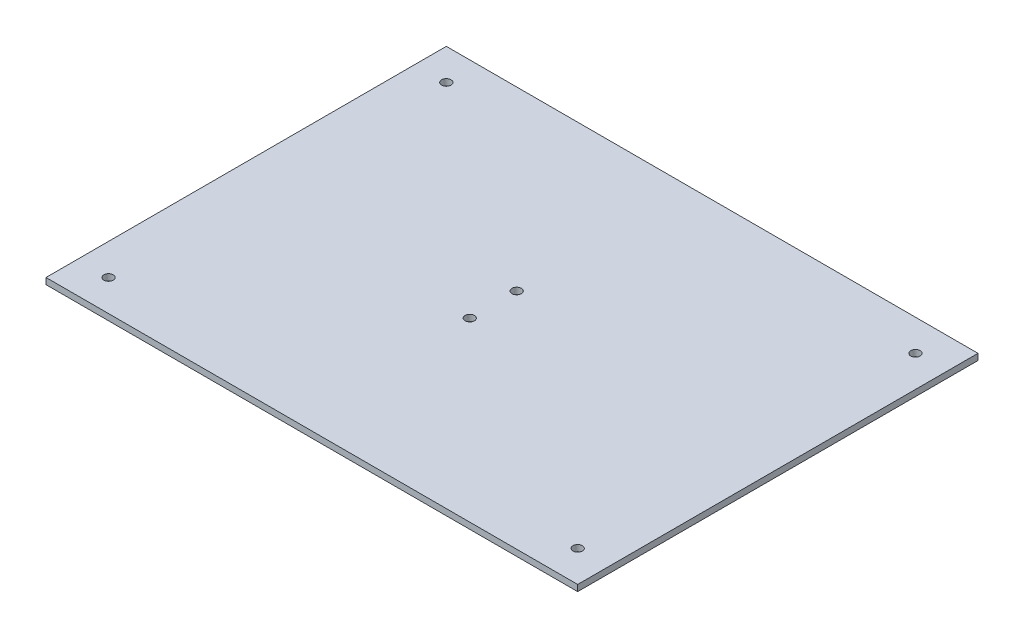
ISO-10303-21;
HEADER;
FILE_DESCRIPTION(('STEP AP214'),'2;1');
FILE_NAME('part.step','',(''),(''),'','','');
FILE_SCHEMA(('AUTOMOTIVE_DESIGN { 1 0 10303 214 1 1 1 1 }'));
ENDSEC;
DATA;
#1=APPLICATION_CONTEXT('core data for automotive mechanical design processes');
#2=APPLICATION_PROTOCOL_DEFINITION('international standard','automotive_design',2000,#1);
#3=PRODUCT_CONTEXT('',#1,'mechanical');
#4=PRODUCT('Part','Part','',(#3));
#5=PRODUCT_RELATED_PRODUCT_CATEGORY('part','',(#4));
#6=PRODUCT_DEFINITION_FORMATION('','',#4);
#7=PRODUCT_DEFINITION_CONTEXT('part definition',#1,'design');
#8=PRODUCT_DEFINITION('design','',#6,#7);
#9=PRODUCT_DEFINITION_SHAPE('','',#8);
#10=(LENGTH_UNIT() NAMED_UNIT(*) SI_UNIT(.MILLI.,.METRE.));
#11=(NAMED_UNIT(*) PLANE_ANGLE_UNIT() SI_UNIT($,.RADIAN.));
#12=(NAMED_UNIT(*) SI_UNIT($,.STERADIAN.) SOLID_ANGLE_UNIT());
#13=UNCERTAINTY_MEASURE_WITH_UNIT(LENGTH_MEASURE(1.E-05),#10,'distance_accuracy_value','');
#14=(GEOMETRIC_REPRESENTATION_CONTEXT(3) GLOBAL_UNCERTAINTY_ASSIGNED_CONTEXT((#13)) GLOBAL_UNIT_ASSIGNED_CONTEXT((#10,
#11,#12)) REPRESENTATION_CONTEXT('',''));
#15=CARTESIAN_POINT('',(0.,0.,0.));
#16=DIRECTION('',(0.,0.,1.));
#17=DIRECTION('',(1.,0.,0.));
#18=AXIS2_PLACEMENT_3D('',#15,#16,#17);
#19=CARTESIAN_POINT('',(0.,2.,0.));
#20=DIRECTION('',(0.,1.,0.));
#21=DIRECTION('',(0.,0.,1.));
#22=AXIS2_PLACEMENT_3D('',#19,#20,#21);
#23=PLANE('',#22);
#24=CARTESIAN_POINT('',(4.64154106963369,2.,2.85845893036635));
#25=DIRECTION('',(0.,1.,0.));
#26=DIRECTION('',(0.,0.,-1.));
#27=AXIS2_PLACEMENT_3D('',#24,#25,#26);
#28=CIRCLE('',#27,1.5);
#29=CARTESIAN_POINT('',(4.64154106963369,2.,1.35845893036635));
#30=VERTEX_POINT('',#29);
#31=EDGE_CURVE('E145',#30,#30,#28,.T.);
#32=ORIENTED_EDGE('',*,*,#31,.F.);
#33=EDGE_LOOP('',(#32));
#34=FACE_BOUND('',#33,.T.);
#35=CARTESIAN_POINT('',(4.64154106963369,2.,17.8584589303664));
#36=DIRECTION('',(0.,1.,0.));
#37=DIRECTION('',(0.,0.,1.));
#38=AXIS2_PLACEMENT_3D('',#35,#36,#37);
#39=CIRCLE('',#38,1.5);
#40=CARTESIAN_POINT('',(4.64154106963369,2.,19.3584589303664));
#41=VERTEX_POINT('',#40);
#42=EDGE_CURVE('E139',#41,#41,#39,.T.);
#43=ORIENTED_EDGE('',*,*,#42,.F.);
#44=EDGE_LOOP('',(#43));
#45=FACE_BOUND('',#44,.T.);
#46=CARTESIAN_POINT('',(85.6415410696337,2.,64.3584589303664));
#47=DIRECTION('',(0.,1.,0.));
#48=DIRECTION('',(0.,0.,1.));
#49=AXIS2_PLACEMENT_3D('',#46,#47,#48);
#50=CIRCLE('',#49,1.5);
#51=CARTESIAN_POINT('',(85.6415410696337,2.,65.8584589303664));
#52=VERTEX_POINT('',#51);
#53=EDGE_CURVE('E124',#52,#52,#50,.T.);
#54=ORIENTED_EDGE('',*,*,#53,.F.);
#55=EDGE_LOOP('',(#54));
#56=FACE_BOUND('',#55,.T.);
#57=CARTESIAN_POINT('',(-64.3584589303663,2.,-43.6415410696336));
#58=DIRECTION('',(0.,1.,0.));
#59=DIRECTION('',(0.,0.,1.));
#60=AXIS2_PLACEMENT_3D('',#57,#58,#59);
#61=CIRCLE('',#60,1.5);
#62=CARTESIAN_POINT('',(-64.3584589303663,2.,-42.1415410696337));
#63=VERTEX_POINT('',#62);
#64=EDGE_CURVE('E103',#63,#63,#61,.T.);
#65=ORIENTED_EDGE('',*,*,#64,.F.);
#66=EDGE_LOOP('',(#65));
#67=FACE_BOUND('',#66,.T.);
#68=DIRECTION('',(0.,0.,-1.));
#69=VECTOR('',#68,1.);
#70=CARTESIAN_POINT('',(95.6415410696337,2.,-53.6415410696336));
#71=LINE('',#70,#69);
#72=CARTESIAN_POINT('',(95.6415410696337,2.,74.3584589303664));
#73=VERTEX_POINT('',#72);
#74=CARTESIAN_POINT('',(95.6415410696337,2.,-53.6415410696336));
#75=VERTEX_POINT('',#74);
#76=EDGE_CURVE('E88',#73,#75,#71,.T.);
#77=ORIENTED_EDGE('',*,*,#76,.T.);
#78=DIRECTION('',(-1.,0.,0.));
#79=VECTOR('',#78,1.);
#80=CARTESIAN_POINT('',(-74.3584589303663,2.,-53.6415410696336));
#81=LINE('',#80,#79);
#82=CARTESIAN_POINT('',(-74.3584589303663,2.,-53.6415410696336));
#83=VERTEX_POINT('',#82);
#84=EDGE_CURVE('E83',#75,#83,#81,.T.);
#85=ORIENTED_EDGE('',*,*,#84,.T.);
#86=DIRECTION('',(0.,0.,1.));
#87=VECTOR('',#86,1.);
#88=CARTESIAN_POINT('',(-74.3584589303663,2.,-53.6415410696336));
#89=LINE('',#88,#87);
#90=CARTESIAN_POINT('',(-74.3584589303663,2.,74.3584589303664));
#91=VERTEX_POINT('',#90);
#92=EDGE_CURVE('E86',#83,#91,#89,.T.);
#93=ORIENTED_EDGE('',*,*,#92,.T.);
#94=DIRECTION('',(1.,0.,0.));
#95=VECTOR('',#94,1.);
#96=CARTESIAN_POINT('',(-74.3584589303663,2.,74.3584589303664));
#97=LINE('',#96,#95);
#98=EDGE_CURVE('E53',#91,#73,#97,.T.);
#99=ORIENTED_EDGE('',*,*,#98,.T.);
#100=EDGE_LOOP('',(#77,#85,#93,#99));
#101=FACE_BOUND('',#100,.T.);
#102=CARTESIAN_POINT('',(85.6415410696337,2.,-43.6415410696337));
#103=DIRECTION('',(0.,1.,0.));
#104=DIRECTION('',(0.,0.,-1.));
#105=AXIS2_PLACEMENT_3D('',#102,#103,#104);
#106=CIRCLE('',#105,1.5);
#107=CARTESIAN_POINT('',(85.6415410696337,2.,-45.1415410696337));
#108=VERTEX_POINT('',#107);
#109=EDGE_CURVE('E118',#108,#108,#106,.T.);
#110=ORIENTED_EDGE('',*,*,#109,.F.);
#111=EDGE_LOOP('',(#110));
#112=FACE_BOUND('',#111,.T.);
#113=CARTESIAN_POINT('',(-64.3584589303663,2.,64.3584589303664));
#114=DIRECTION('',(0.,1.,0.));
#115=DIRECTION('',(0.,0.,-1.));
#116=AXIS2_PLACEMENT_3D('',#113,#114,#115);
#117=CIRCLE('',#116,1.5);
#118=CARTESIAN_POINT('',(-64.3584589303663,2.,62.8584589303663));
#119=VERTEX_POINT('',#118);
#120=EDGE_CURVE('E130',#119,#119,#117,.T.);
#121=ORIENTED_EDGE('',*,*,#120,.F.);
#122=EDGE_LOOP('',(#121));
#123=FACE_BOUND('',#122,.T.);
#124=ADVANCED_FACE('F36',(#34,#45,#56,#67,#101,#112,#123),#23,.T.);
#125=CARTESIAN_POINT('',(0.,0.,0.));
#126=DIRECTION('',(0.,1.,0.));
#127=DIRECTION('',(0.,0.,1.));
#128=AXIS2_PLACEMENT_3D('',#125,#126,#127);
#129=PLANE('',#128);
#130=CARTESIAN_POINT('',(4.64154106963369,0.,2.85845893036635));
#131=DIRECTION('',(0.,1.,0.));
#132=DIRECTION('',(0.,0.,-1.));
#133=AXIS2_PLACEMENT_3D('',#130,#131,#132);
#134=CIRCLE('',#133,1.5);
#135=CARTESIAN_POINT('',(4.64154106963369,0.,1.35845893036635));
#136=VERTEX_POINT('',#135);
#137=EDGE_CURVE('E142',#136,#136,#134,.T.);
#138=ORIENTED_EDGE('',*,*,#137,.T.);
#139=EDGE_LOOP('',(#138));
#140=FACE_BOUND('',#139,.T.);
#141=CARTESIAN_POINT('',(4.64154106963369,0.,17.8584589303664));
#142=DIRECTION('',(0.,1.,0.));
#143=DIRECTION('',(0.,0.,1.));
#144=AXIS2_PLACEMENT_3D('',#141,#142,#143);
#145=CIRCLE('',#144,1.5);
#146=CARTESIAN_POINT('',(4.64154106963369,0.,19.3584589303664));
#147=VERTEX_POINT('',#146);
#148=EDGE_CURVE('E136',#147,#147,#145,.T.);
#149=ORIENTED_EDGE('',*,*,#148,.T.);
#150=EDGE_LOOP('',(#149));
#151=FACE_BOUND('',#150,.T.);
#152=DIRECTION('',(0.,0.,-1.));
#153=VECTOR('',#152,1.);
#154=CARTESIAN_POINT('',(95.6415410696337,0.,-53.6415410696336));
#155=LINE('',#154,#153);
#156=CARTESIAN_POINT('',(95.6415410696337,0.,74.3584589303664));
#157=VERTEX_POINT('',#156);
#158=CARTESIAN_POINT('',(95.6415410696337,0.,-53.6415410696336));
#159=VERTEX_POINT('',#158);
#160=EDGE_CURVE('E100',#157,#159,#155,.T.);
#161=ORIENTED_EDGE('',*,*,#160,.F.);
#162=DIRECTION('',(1.,0.,0.));
#163=VECTOR('',#162,1.);
#164=CARTESIAN_POINT('',(-74.3584589303663,0.,74.3584589303664));
#165=LINE('',#164,#163);
#166=CARTESIAN_POINT('',(-74.3584589303663,0.,74.3584589303664));
#167=VERTEX_POINT('',#166);
#168=EDGE_CURVE('E76',#167,#157,#165,.T.);
#169=ORIENTED_EDGE('',*,*,#168,.F.);
#170=DIRECTION('',(0.,0.,1.));
#171=VECTOR('',#170,1.);
#172=CARTESIAN_POINT('',(-74.3584589303663,0.,-53.6415410696336));
#173=LINE('',#172,#171);
#174=CARTESIAN_POINT('',(-74.3584589303663,0.,-53.6415410696336));
#175=VERTEX_POINT('',#174);
#176=EDGE_CURVE('E70',#175,#167,#173,.T.);
#177=ORIENTED_EDGE('',*,*,#176,.F.);
#178=DIRECTION('',(-1.,0.,0.));
#179=VECTOR('',#178,1.);
#180=CARTESIAN_POINT('',(-74.3584589303663,0.,-53.6415410696336));
#181=LINE('',#180,#179);
#182=EDGE_CURVE('E92',#159,#175,#181,.T.);
#183=ORIENTED_EDGE('',*,*,#182,.F.);
#184=EDGE_LOOP('',(#161,#169,#177,#183));
#185=FACE_BOUND('',#184,.T.);
#186=CARTESIAN_POINT('',(-64.3584589303663,0.,-43.6415410696336));
#187=DIRECTION('',(0.,1.,0.));
#188=DIRECTION('',(0.,0.,1.));
#189=AXIS2_PLACEMENT_3D('',#186,#187,#188);
#190=CIRCLE('',#189,1.5);
#191=CARTESIAN_POINT('',(-64.3584589303663,0.,-42.1415410696337));
#192=VERTEX_POINT('',#191);
#193=EDGE_CURVE('E115',#192,#192,#190,.T.);
#194=ORIENTED_EDGE('',*,*,#193,.T.);
#195=EDGE_LOOP('',(#194));
#196=FACE_BOUND('',#195,.T.);
#197=CARTESIAN_POINT('',(85.6415410696337,0.,-43.6415410696337));
#198=DIRECTION('',(0.,1.,0.));
#199=DIRECTION('',(0.,0.,-1.));
#200=AXIS2_PLACEMENT_3D('',#197,#198,#199);
#201=CIRCLE('',#200,1.5);
#202=CARTESIAN_POINT('',(85.6415410696337,0.,-45.1415410696337));
#203=VERTEX_POINT('',#202);
#204=EDGE_CURVE('E121',#203,#203,#201,.T.);
#205=ORIENTED_EDGE('',*,*,#204,.T.);
#206=EDGE_LOOP('',(#205));
#207=FACE_BOUND('',#206,.T.);
#208=CARTESIAN_POINT('',(85.6415410696337,0.,64.3584589303664));
#209=DIRECTION('',(0.,1.,0.));
#210=DIRECTION('',(0.,0.,1.));
#211=AXIS2_PLACEMENT_3D('',#208,#209,#210);
#212=CIRCLE('',#211,1.5);
#213=CARTESIAN_POINT('',(85.6415410696337,0.,65.8584589303664));
#214=VERTEX_POINT('',#213);
#215=EDGE_CURVE('E127',#214,#214,#212,.T.);
#216=ORIENTED_EDGE('',*,*,#215,.T.);
#217=EDGE_LOOP('',(#216));
#218=FACE_BOUND('',#217,.T.);
#219=CARTESIAN_POINT('',(-64.3584589303663,0.,64.3584589303664));
#220=DIRECTION('',(0.,1.,0.));
#221=DIRECTION('',(0.,0.,-1.));
#222=AXIS2_PLACEMENT_3D('',#219,#220,#221);
#223=CIRCLE('',#222,1.5);
#224=CARTESIAN_POINT('',(-64.3584589303663,0.,62.8584589303663));
#225=VERTEX_POINT('',#224);
#226=EDGE_CURVE('E133',#225,#225,#223,.T.);
#227=ORIENTED_EDGE('',*,*,#226,.T.);
#228=EDGE_LOOP('',(#227));
#229=FACE_BOUND('',#228,.T.);
#230=ADVANCED_FACE('F111',(#140,#151,#185,#196,#207,#218,#229),#129,.F.);
#231=CARTESIAN_POINT('',(95.6415410696337,2.,-53.6415410696336));
#232=DIRECTION('',(-1.,0.,0.));
#233=DIRECTION('',(0.,0.,1.));
#234=AXIS2_PLACEMENT_3D('',#231,#232,#233);
#235=PLANE('',#234);
#236=ORIENTED_EDGE('',*,*,#160,.T.);
#237=DIRECTION('',(0.,-1.,0.));
#238=VECTOR('',#237,1.);
#239=CARTESIAN_POINT('',(95.6415410696337,2.,-53.6415410696336));
#240=LINE('',#239,#238);
#241=EDGE_CURVE('E11',#75,#159,#240,.T.);
#242=ORIENTED_EDGE('',*,*,#241,.F.);
#243=ORIENTED_EDGE('',*,*,#76,.F.);
#244=DIRECTION('',(0.,-1.,0.));
#245=VECTOR('',#244,1.);
#246=CARTESIAN_POINT('',(95.6415410696337,2.,74.3584589303664));
#247=LINE('',#246,#245);
#248=EDGE_CURVE('E96',#73,#157,#247,.T.);
#249=ORIENTED_EDGE('',*,*,#248,.T.);
#250=EDGE_LOOP('',(#236,#242,#243,#249));
#251=FACE_BOUND('',#250,.T.);
#252=ADVANCED_FACE('F38',(#251),#235,.F.);
#253=CARTESIAN_POINT('',(-74.3584589303663,2.,-53.6415410696336));
#254=DIRECTION('',(0.,0.,1.));
#255=DIRECTION('',(1.,0.,0.));
#256=AXIS2_PLACEMENT_3D('',#253,#254,#255);
#257=PLANE('',#256);
#258=ORIENTED_EDGE('',*,*,#182,.T.);
#259=DIRECTION('',(0.,-1.,0.));
#260=VECTOR('',#259,1.);
#261=CARTESIAN_POINT('',(-74.3584589303663,2.,-53.6415410696336));
#262=LINE('',#261,#260);
#263=EDGE_CURVE('E45',#83,#175,#262,.T.);
#264=ORIENTED_EDGE('',*,*,#263,.F.);
#265=ORIENTED_EDGE('',*,*,#84,.F.);
#266=ORIENTED_EDGE('',*,*,#241,.T.);
#267=EDGE_LOOP('',(#258,#264,#265,#266));
#268=FACE_BOUND('',#267,.T.);
#269=ADVANCED_FACE('F91',(#268),#257,.F.);
#270=CARTESIAN_POINT('',(-74.3584589303663,2.,-53.6415410696336));
#271=DIRECTION('',(1.,0.,0.));
#272=DIRECTION('',(0.,0.,-1.));
#273=AXIS2_PLACEMENT_3D('',#270,#271,#272);
#274=PLANE('',#273);
#275=ORIENTED_EDGE('',*,*,#176,.T.);
#276=DIRECTION('',(0.,-1.,0.));
#277=VECTOR('',#276,1.);
#278=CARTESIAN_POINT('',(-74.3584589303663,2.,74.3584589303664));
#279=LINE('',#278,#277);
#280=EDGE_CURVE('E93',#91,#167,#279,.T.);
#281=ORIENTED_EDGE('',*,*,#280,.F.);
#282=ORIENTED_EDGE('',*,*,#92,.F.);
#283=ORIENTED_EDGE('',*,*,#263,.T.);
#284=EDGE_LOOP('',(#275,#281,#282,#283));
#285=FACE_BOUND('',#284,.T.);
#286=ADVANCED_FACE('F94',(#285),#274,.F.);
#287=CARTESIAN_POINT('',(-74.3584589303663,2.,74.3584589303664));
#288=DIRECTION('',(0.,0.,-1.));
#289=DIRECTION('',(-1.,0.,0.));
#290=AXIS2_PLACEMENT_3D('',#287,#288,#289);
#291=PLANE('',#290);
#292=ORIENTED_EDGE('',*,*,#168,.T.);
#293=ORIENTED_EDGE('',*,*,#248,.F.);
#294=ORIENTED_EDGE('',*,*,#98,.F.);
#295=ORIENTED_EDGE('',*,*,#280,.T.);
#296=EDGE_LOOP('',(#292,#293,#294,#295));
#297=FACE_BOUND('',#296,.T.);
#298=ADVANCED_FACE('F108',(#297),#291,.F.);
#299=CARTESIAN_POINT('',(-64.3584589303663,2.,-43.6415410696336));
#300=DIRECTION('',(0.,-1.,0.));
#301=DIRECTION('',(0.,0.,-1.));
#302=AXIS2_PLACEMENT_3D('',#299,#300,#301);
#303=CYLINDRICAL_SURFACE('',#302,1.5);
#304=ORIENTED_EDGE('',*,*,#64,.T.);
#305=EDGE_LOOP('',(#304));
#306=FACE_BOUND('',#305,.T.);
#307=ORIENTED_EDGE('',*,*,#193,.F.);
#308=EDGE_LOOP('',(#307));
#309=FACE_BOUND('',#308,.T.);
#310=ADVANCED_FACE('F169',(#306,#309),#303,.F.);
#311=CARTESIAN_POINT('',(85.6415410696337,2.,-43.6415410696337));
#312=DIRECTION('',(0.,-1.,0.));
#313=DIRECTION('',(0.,0.,-1.));
#314=AXIS2_PLACEMENT_3D('',#311,#312,#313);
#315=CYLINDRICAL_SURFACE('',#314,1.5);
#316=ORIENTED_EDGE('',*,*,#109,.T.);
#317=EDGE_LOOP('',(#316));
#318=FACE_BOUND('',#317,.T.);
#319=ORIENTED_EDGE('',*,*,#204,.F.);
#320=EDGE_LOOP('',(#319));
#321=FACE_BOUND('',#320,.T.);
#322=ADVANCED_FACE('F172',(#318,#321),#315,.F.);
#323=CARTESIAN_POINT('',(85.6415410696337,2.,64.3584589303664));
#324=DIRECTION('',(0.,-1.,0.));
#325=DIRECTION('',(0.,0.,-1.));
#326=AXIS2_PLACEMENT_3D('',#323,#324,#325);
#327=CYLINDRICAL_SURFACE('',#326,1.5);
#328=ORIENTED_EDGE('',*,*,#53,.T.);
#329=EDGE_LOOP('',(#328));
#330=FACE_BOUND('',#329,.T.);
#331=ORIENTED_EDGE('',*,*,#215,.F.);
#332=EDGE_LOOP('',(#331));
#333=FACE_BOUND('',#332,.T.);
#334=ADVANCED_FACE('F186',(#330,#333),#327,.F.);
#335=CARTESIAN_POINT('',(-64.3584589303663,2.,64.3584589303664));
#336=DIRECTION('',(0.,-1.,0.));
#337=DIRECTION('',(0.,0.,-1.));
#338=AXIS2_PLACEMENT_3D('',#335,#336,#337);
#339=CYLINDRICAL_SURFACE('',#338,1.5);
#340=ORIENTED_EDGE('',*,*,#120,.T.);
#341=EDGE_LOOP('',(#340));
#342=FACE_BOUND('',#341,.T.);
#343=ORIENTED_EDGE('',*,*,#226,.F.);
#344=EDGE_LOOP('',(#343));
#345=FACE_BOUND('',#344,.T.);
#346=ADVANCED_FACE('F184',(#342,#345),#339,.F.);
#347=CARTESIAN_POINT('',(4.64154106963369,0.,17.8584589303664));
#348=DIRECTION('',(0.,1.,0.));
#349=DIRECTION('',(0.,0.,1.));
#350=AXIS2_PLACEMENT_3D('',#347,#348,#349);
#351=CYLINDRICAL_SURFACE('',#350,1.5);
#352=ORIENTED_EDGE('',*,*,#148,.F.);
#353=EDGE_LOOP('',(#352));
#354=FACE_BOUND('',#353,.T.);
#355=ORIENTED_EDGE('',*,*,#42,.T.);
#356=EDGE_LOOP('',(#355));
#357=FACE_BOUND('',#356,.T.);
#358=ADVANCED_FACE('F156',(#354,#357),#351,.F.);
#359=CARTESIAN_POINT('',(4.64154106963369,0.,2.85845893036635));
#360=DIRECTION('',(0.,1.,0.));
#361=DIRECTION('',(0.,0.,1.));
#362=AXIS2_PLACEMENT_3D('',#359,#360,#361);
#363=CYLINDRICAL_SURFACE('',#362,1.5);
#364=ORIENTED_EDGE('',*,*,#137,.F.);
#365=EDGE_LOOP('',(#364));
#366=FACE_BOUND('',#365,.T.);
#367=ORIENTED_EDGE('',*,*,#31,.T.);
#368=EDGE_LOOP('',(#367));
#369=FACE_BOUND('',#368,.T.);
#370=ADVANCED_FACE('F153',(#366,#369),#363,.F.);
#371=CLOSED_SHELL('',(#124,#230,#252,#269,#286,#298,#310,#322,#334,#346,#358,#370));
#372=MANIFOLD_SOLID_BREP('B2',#371);
#373=ADVANCED_BREP_SHAPE_REPRESENTATION('',(#18,#372),#14);
#374=SHAPE_DEFINITION_REPRESENTATION(#9,#373);
ENDSEC;
END-ISO-10303-21;
